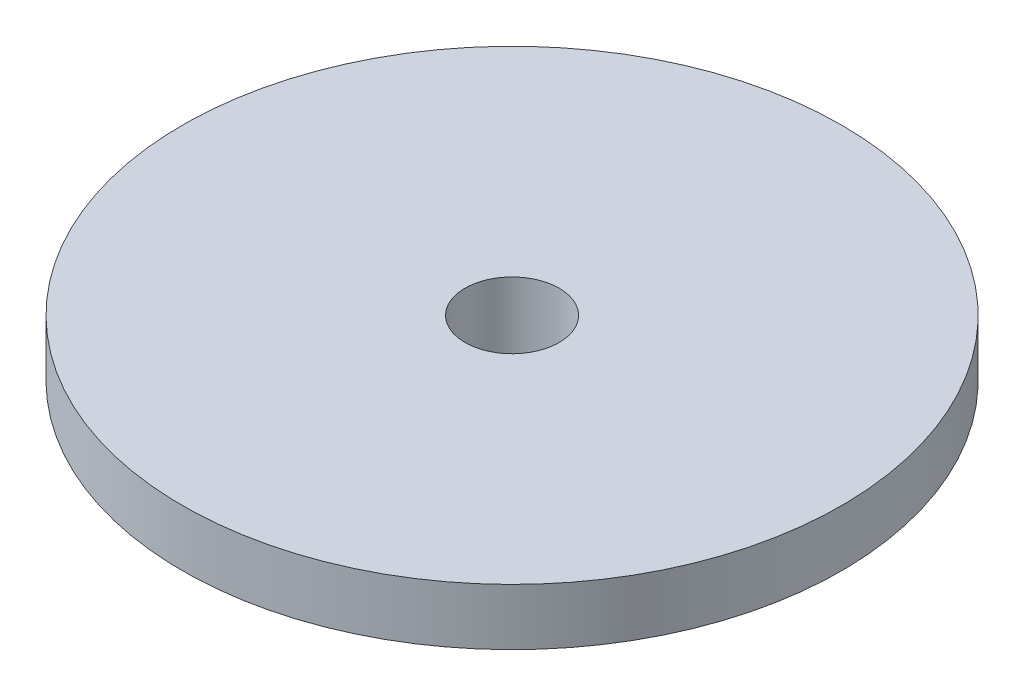
ISO-10303-21;
HEADER;
FILE_DESCRIPTION(('STEP AP214'),'2;1');
FILE_NAME('part.step','',(''),(''),'','','');
FILE_SCHEMA(('AUTOMOTIVE_DESIGN { 1 0 10303 214 1 1 1 1 }'));
ENDSEC;
DATA;
#1=APPLICATION_CONTEXT('core data for automotive mechanical design processes');
#2=APPLICATION_PROTOCOL_DEFINITION('international standard','automotive_design',2000,#1);
#3=PRODUCT_CONTEXT('',#1,'mechanical');
#4=PRODUCT('Part','Part','',(#3));
#5=PRODUCT_RELATED_PRODUCT_CATEGORY('part','',(#4));
#6=PRODUCT_DEFINITION_FORMATION('','',#4);
#7=PRODUCT_DEFINITION_CONTEXT('part definition',#1,'design');
#8=PRODUCT_DEFINITION('design','',#6,#7);
#9=PRODUCT_DEFINITION_SHAPE('','',#8);
#10=(LENGTH_UNIT() NAMED_UNIT(*) SI_UNIT(.MILLI.,.METRE.));
#11=(NAMED_UNIT(*) PLANE_ANGLE_UNIT() SI_UNIT($,.RADIAN.));
#12=(NAMED_UNIT(*) SI_UNIT($,.STERADIAN.) SOLID_ANGLE_UNIT());
#13=UNCERTAINTY_MEASURE_WITH_UNIT(LENGTH_MEASURE(1.E-05),#10,'distance_accuracy_value','');
#14=(GEOMETRIC_REPRESENTATION_CONTEXT(3) GLOBAL_UNCERTAINTY_ASSIGNED_CONTEXT((#13)) GLOBAL_UNIT_ASSIGNED_CONTEXT((#10,
#11,#12)) REPRESENTATION_CONTEXT('',''));
#15=CARTESIAN_POINT('',(0.,0.,0.));
#16=DIRECTION('',(0.,0.,1.));
#17=DIRECTION('',(1.,0.,0.));
#18=AXIS2_PLACEMENT_3D('',#15,#16,#17);
#19=CARTESIAN_POINT('',(0.,10.,0.));
#20=DIRECTION('',(0.,-1.,0.));
#21=DIRECTION('',(0.,0.,-1.));
#22=AXIS2_PLACEMENT_3D('',#19,#20,#21);
#23=CYLINDRICAL_SURFACE('',#22,2.5);
#24=CARTESIAN_POINT('',(0.,10.,0.));
#25=DIRECTION('',(0.,-1.,0.));
#26=DIRECTION('',(0.,0.,-1.));
#27=AXIS2_PLACEMENT_3D('',#24,#25,#26);
#28=CIRCLE('',#27,2.5);
#29=CARTESIAN_POINT('',(0.,10.,-2.5));
#30=VERTEX_POINT('',#29);
#31=EDGE_CURVE('E63',#30,#30,#28,.T.);
#32=ORIENTED_EDGE('',*,*,#31,.F.);
#33=EDGE_LOOP('',(#32));
#34=FACE_BOUND('',#33,.T.);
#35=CARTESIAN_POINT('',(0.,5.,0.));
#36=DIRECTION('',(0.,-1.,0.));
#37=DIRECTION('',(0.,0.,-1.));
#38=AXIS2_PLACEMENT_3D('',#35,#36,#37);
#39=CIRCLE('',#38,2.5);
#40=CARTESIAN_POINT('',(0.,5.,-2.5));
#41=VERTEX_POINT('',#40);
#42=EDGE_CURVE('E47',#41,#41,#39,.F.);
#43=ORIENTED_EDGE('',*,*,#42,.F.);
#44=EDGE_LOOP('',(#43));
#45=FACE_BOUND('',#44,.T.);
#46=ADVANCED_FACE('F43',(#34,#45),#23,.F.);
#47=CARTESIAN_POINT('',(7.,0.,0.));
#48=DIRECTION('',(0.,-1.,0.));
#49=DIRECTION('',(0.,0.,-1.));
#50=AXIS2_PLACEMENT_3D('',#47,#48,#49);
#51=PLANE('',#50);
#52=CARTESIAN_POINT('',(0.,0.,0.));
#53=DIRECTION('',(0.,-1.,0.));
#54=DIRECTION('',(0.,0.,-1.));
#55=AXIS2_PLACEMENT_3D('',#52,#53,#54);
#56=CIRCLE('',#55,4.5);
#57=CARTESIAN_POINT('',(0.,0.,-4.5));
#58=VERTEX_POINT('',#57);
#59=EDGE_CURVE('E67',#58,#58,#56,.T.);
#60=ORIENTED_EDGE('',*,*,#59,.F.);
#61=EDGE_LOOP('',(#60));
#62=FACE_BOUND('',#61,.T.);
#63=CARTESIAN_POINT('',(0.,0.,0.));
#64=DIRECTION('',(0.,-1.,0.));
#65=DIRECTION('',(0.,0.,-1.));
#66=AXIS2_PLACEMENT_3D('',#63,#64,#65);
#67=CIRCLE('',#66,7.);
#68=CARTESIAN_POINT('',(0.,0.,-7.));
#69=VERTEX_POINT('',#68);
#70=EDGE_CURVE('E57',#69,#69,#67,.T.);
#71=ORIENTED_EDGE('',*,*,#70,.T.);
#72=EDGE_LOOP('',(#71));
#73=FACE_BOUND('',#72,.T.);
#74=ADVANCED_FACE('F45',(#62,#73),#51,.T.);
#75=CARTESIAN_POINT('',(0.,10.,0.));
#76=DIRECTION('',(0.,1.,0.));
#77=DIRECTION('',(0.,0.,1.));
#78=AXIS2_PLACEMENT_3D('',#75,#76,#77);
#79=PLANE('',#78);
#80=ORIENTED_EDGE('',*,*,#31,.T.);
#81=EDGE_LOOP('',(#80));
#82=FACE_BOUND('',#81,.T.);
#83=CARTESIAN_POINT('',(0.,10.,0.));
#84=DIRECTION('',(0.,-1.,0.));
#85=DIRECTION('',(0.,0.,-1.));
#86=AXIS2_PLACEMENT_3D('',#83,#84,#85);
#87=CIRCLE('',#86,17.5);
#88=CARTESIAN_POINT('',(0.,10.,-17.5));
#89=VERTEX_POINT('',#88);
#90=EDGE_CURVE('E10',#89,#89,#87,.T.);
#91=ORIENTED_EDGE('',*,*,#90,.F.);
#92=EDGE_LOOP('',(#91));
#93=FACE_BOUND('',#92,.T.);
#94=ADVANCED_FACE('F89',(#82,#93),#79,.T.);
#95=CARTESIAN_POINT('',(0.,0.,0.));
#96=DIRECTION('',(0.,-1.,0.));
#97=DIRECTION('',(0.,0.,-1.));
#98=AXIS2_PLACEMENT_3D('',#95,#96,#97);
#99=CYLINDRICAL_SURFACE('',#98,17.5);
#100=ORIENTED_EDGE('',*,*,#90,.T.);
#101=EDGE_LOOP('',(#100));
#102=FACE_BOUND('',#101,.T.);
#103=CARTESIAN_POINT('',(0.,7.,0.));
#104=DIRECTION('',(0.,-1.,0.));
#105=DIRECTION('',(0.,0.,-1.));
#106=AXIS2_PLACEMENT_3D('',#103,#104,#105);
#107=CIRCLE('',#106,17.5);
#108=CARTESIAN_POINT('',(0.,7.,-17.5));
#109=VERTEX_POINT('',#108);
#110=EDGE_CURVE('E52',#109,#109,#107,.T.);
#111=ORIENTED_EDGE('',*,*,#110,.F.);
#112=EDGE_LOOP('',(#111));
#113=FACE_BOUND('',#112,.T.);
#114=ADVANCED_FACE('F99',(#102,#113),#99,.T.);
#115=CARTESIAN_POINT('',(0.,0.,0.));
#116=DIRECTION('',(0.,1.,0.));
#117=DIRECTION('',(0.,0.,1.));
#118=AXIS2_PLACEMENT_3D('',#115,#116,#117);
#119=CONICAL_SURFACE('',#118,7.,0.982793723247329);
#120=ORIENTED_EDGE('',*,*,#110,.T.);
#121=EDGE_LOOP('',(#120));
#122=FACE_BOUND('',#121,.T.);
#123=ORIENTED_EDGE('',*,*,#70,.F.);
#124=EDGE_LOOP('',(#123));
#125=FACE_BOUND('',#124,.T.);
#126=ADVANCED_FACE('F96',(#122,#125),#119,.T.);
#127=CARTESIAN_POINT('',(0.,5.,0.));
#128=DIRECTION('',(0.,-1.,0.));
#129=DIRECTION('',(0.,0.,-1.));
#130=AXIS2_PLACEMENT_3D('',#127,#128,#129);
#131=PLANE('',#130);
#132=CARTESIAN_POINT('',(0.,5.,0.));
#133=DIRECTION('',(0.,-1.,0.));
#134=DIRECTION('',(0.,0.,-1.));
#135=AXIS2_PLACEMENT_3D('',#132,#133,#134);
#136=CIRCLE('',#135,4.5);
#137=CARTESIAN_POINT('',(0.,5.,-4.5));
#138=VERTEX_POINT('',#137);
#139=EDGE_CURVE('E71',#138,#138,#136,.T.);
#140=ORIENTED_EDGE('',*,*,#139,.T.);
#141=EDGE_LOOP('',(#140));
#142=FACE_BOUND('',#141,.T.);
#143=ORIENTED_EDGE('',*,*,#42,.T.);
#144=EDGE_LOOP('',(#143));
#145=FACE_BOUND('',#144,.T.);
#146=ADVANCED_FACE('F80',(#142,#145),#131,.T.);
#147=CARTESIAN_POINT('',(0.,5.,0.));
#148=DIRECTION('',(0.,-1.,0.));
#149=DIRECTION('',(0.,0.,-1.));
#150=AXIS2_PLACEMENT_3D('',#147,#148,#149);
#151=CYLINDRICAL_SURFACE('',#150,4.5);
#152=ORIENTED_EDGE('',*,*,#139,.F.);
#153=EDGE_LOOP('',(#152));
#154=FACE_BOUND('',#153,.T.);
#155=ORIENTED_EDGE('',*,*,#59,.T.);
#156=EDGE_LOOP('',(#155));
#157=FACE_BOUND('',#156,.T.);
#158=ADVANCED_FACE('F94',(#154,#157),#151,.F.);
#159=CLOSED_SHELL('',(#46,#74,#94,#114,#126,#146,#158));
#160=MANIFOLD_SOLID_BREP('B2',#159);
#161=ADVANCED_BREP_SHAPE_REPRESENTATION('',(#18,#160),#14);
#162=SHAPE_DEFINITION_REPRESENTATION(#9,#161);
ENDSEC;
END-ISO-10303-21;
